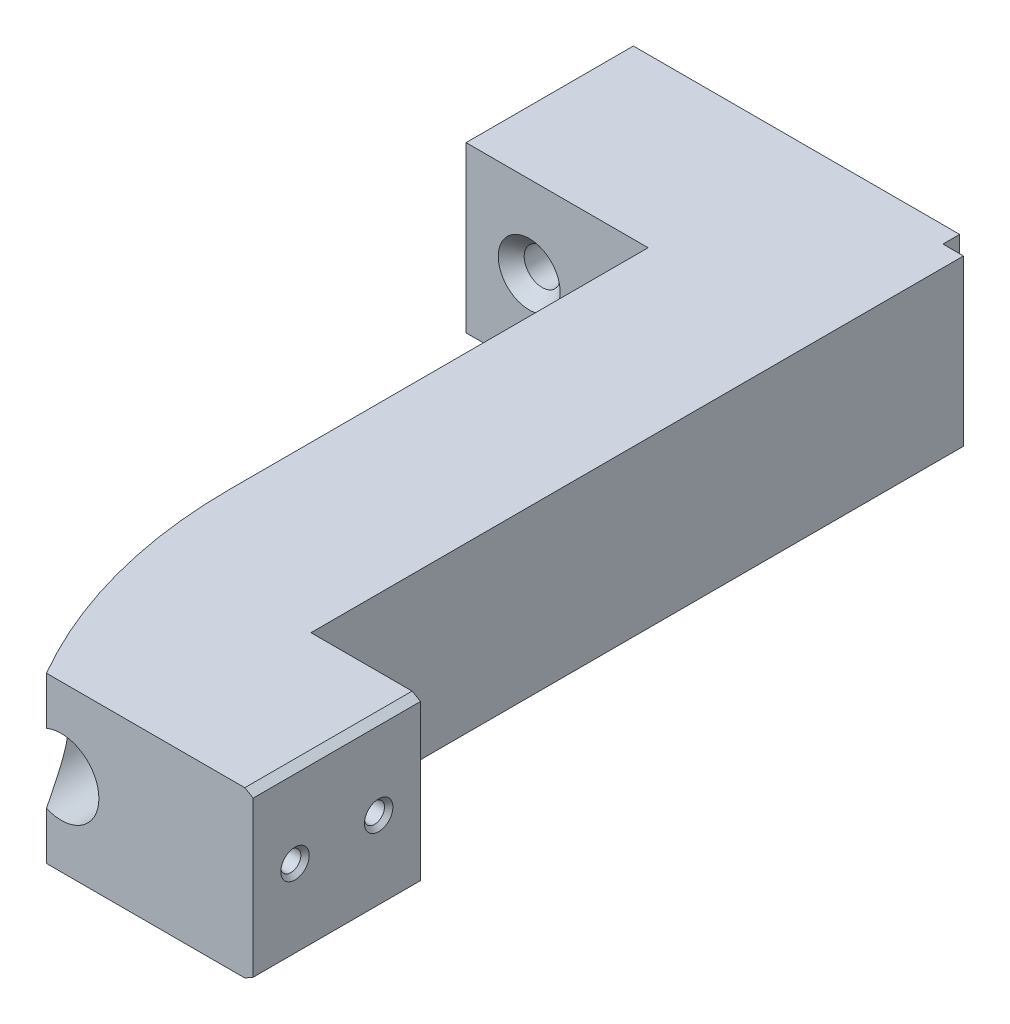
ISO-10303-21;
HEADER;
FILE_DESCRIPTION(('STEP AP214'),'2;1');
FILE_NAME('part.step','',(''),(''),'','','');
FILE_SCHEMA(('AUTOMOTIVE_DESIGN { 1 0 10303 214 1 1 1 1 }'));
ENDSEC;
DATA;
#1=APPLICATION_CONTEXT('core data for automotive mechanical design processes');
#2=APPLICATION_PROTOCOL_DEFINITION('international standard','automotive_design',2000,#1);
#3=PRODUCT_CONTEXT('',#1,'mechanical');
#4=PRODUCT('Part','Part','',(#3));
#5=PRODUCT_RELATED_PRODUCT_CATEGORY('part','',(#4));
#6=PRODUCT_DEFINITION_FORMATION('','',#4);
#7=PRODUCT_DEFINITION_CONTEXT('part definition',#1,'design');
#8=PRODUCT_DEFINITION('design','',#6,#7);
#9=PRODUCT_DEFINITION_SHAPE('','',#8);
#10=(LENGTH_UNIT() NAMED_UNIT(*) SI_UNIT(.MILLI.,.METRE.));
#11=(NAMED_UNIT(*) PLANE_ANGLE_UNIT() SI_UNIT($,.RADIAN.));
#12=(NAMED_UNIT(*) SI_UNIT($,.STERADIAN.) SOLID_ANGLE_UNIT());
#13=UNCERTAINTY_MEASURE_WITH_UNIT(LENGTH_MEASURE(1.E-05),#10,'distance_accuracy_value','');
#14=(GEOMETRIC_REPRESENTATION_CONTEXT(3) GLOBAL_UNCERTAINTY_ASSIGNED_CONTEXT((#13)) GLOBAL_UNIT_ASSIGNED_CONTEXT((#10,
#11,#12)) REPRESENTATION_CONTEXT('',''));
#15=CARTESIAN_POINT('',(0.,0.,0.));
#16=DIRECTION('',(0.,0.,1.));
#17=DIRECTION('',(1.,0.,0.));
#18=AXIS2_PLACEMENT_3D('',#15,#16,#17);
#19=CARTESIAN_POINT('',(41.4630883490828,0.,100.));
#20=DIRECTION('',(-1.,0.,0.));
#21=DIRECTION('',(0.,0.,1.));
#22=AXIS2_PLACEMENT_3D('',#19,#20,#21);
#23=PLANE('',#22);
#24=DIRECTION('',(0.,1.,0.));
#25=VECTOR('',#24,1.);
#26=CARTESIAN_POINT('',(41.4630883490828,19.7,80.));
#27=LINE('',#26,#25);
#28=CARTESIAN_POINT('',(41.4630883490828,0.,80.));
#29=VERTEX_POINT('',#28);
#30=CARTESIAN_POINT('',(41.4630883490828,19.7,80.));
#31=VERTEX_POINT('',#30);
#32=EDGE_CURVE('E168',#29,#31,#27,.T.);
#33=ORIENTED_EDGE('',*,*,#32,.F.);
#34=DIRECTION('',(0.,0.,-1.));
#35=VECTOR('',#34,1.);
#36=CARTESIAN_POINT('',(41.4630883490828,0.,100.));
#37=LINE('',#36,#35);
#38=CARTESIAN_POINT('',(41.4630883490828,0.,2.));
#39=VERTEX_POINT('',#38);
#40=EDGE_CURVE('E348',#29,#39,#37,.T.);
#41=ORIENTED_EDGE('',*,*,#40,.T.);
#42=DIRECTION('',(0.,-1.,0.));
#43=VECTOR('',#42,1.);
#44=CARTESIAN_POINT('',(41.4630883490828,19.7,2.));
#45=LINE('',#44,#43);
#46=CARTESIAN_POINT('',(41.4630883490828,19.7,2.));
#47=VERTEX_POINT('',#46);
#48=EDGE_CURVE('E371',#47,#39,#45,.T.);
#49=ORIENTED_EDGE('',*,*,#48,.F.);
#50=DIRECTION('',(0.,0.,-1.));
#51=VECTOR('',#50,1.);
#52=CARTESIAN_POINT('',(41.4630883490828,19.7,100.));
#53=LINE('',#52,#51);
#54=EDGE_CURVE('E350',#31,#47,#53,.T.);
#55=ORIENTED_EDGE('',*,*,#54,.F.);
#56=EDGE_LOOP('',(#33,#41,#49,#55));
#57=FACE_BOUND('',#56,.T.);
#58=ADVANCED_FACE('F35',(#57),#23,.F.);
#59=CARTESIAN_POINT('',(39.,0.,20.));
#60=DIRECTION('',(-1.,0.,0.));
#61=DIRECTION('',(0.,0.,1.));
#62=AXIS2_PLACEMENT_3D('',#59,#60,#61);
#63=PLANE('',#62);
#64=DIRECTION('',(0.,1.,0.));
#65=VECTOR('',#64,1.);
#66=CARTESIAN_POINT('',(39.,19.7,2.));
#67=LINE('',#66,#65);
#68=CARTESIAN_POINT('',(39.,0.,2.));
#69=VERTEX_POINT('',#68);
#70=CARTESIAN_POINT('',(39.,19.7,2.));
#71=VERTEX_POINT('',#70);
#72=EDGE_CURVE('E199',#69,#71,#67,.T.);
#73=ORIENTED_EDGE('',*,*,#72,.F.);
#74=DIRECTION('',(0.,0.,-1.));
#75=VECTOR('',#74,1.);
#76=CARTESIAN_POINT('',(39.,0.,20.));
#77=LINE('',#76,#75);
#78=CARTESIAN_POINT('',(39.,0.,0.));
#79=VERTEX_POINT('',#78);
#80=EDGE_CURVE('E304',#69,#79,#77,.T.);
#81=ORIENTED_EDGE('',*,*,#80,.T.);
#82=DIRECTION('',(0.,1.,0.));
#83=VECTOR('',#82,1.);
#84=CARTESIAN_POINT('',(39.,0.,0.));
#85=LINE('',#84,#83);
#86=CARTESIAN_POINT('',(39.,19.7,0.));
#87=VERTEX_POINT('',#86);
#88=EDGE_CURVE('E315',#79,#87,#85,.T.);
#89=ORIENTED_EDGE('',*,*,#88,.T.);
#90=DIRECTION('',(0.,0.,-1.));
#91=VECTOR('',#90,1.);
#92=CARTESIAN_POINT('',(39.,19.7,20.));
#93=LINE('',#92,#91);
#94=EDGE_CURVE('E306',#71,#87,#93,.T.);
#95=ORIENTED_EDGE('',*,*,#94,.F.);
#96=EDGE_LOOP('',(#73,#81,#89,#95));
#97=FACE_BOUND('',#96,.T.);
#98=ADVANCED_FACE('F224',(#97),#63,.F.);
#99=CARTESIAN_POINT('',(0.,0.,20.));
#100=DIRECTION('',(0.,0.,-1.));
#101=DIRECTION('',(-1.,0.,0.));
#102=AXIS2_PLACEMENT_3D('',#99,#100,#101);
#103=PLANE('',#102);
#104=CARTESIAN_POINT('',(7.55,9.85,20.));
#105=DIRECTION('',(0.,0.,1.));
#106=DIRECTION('',(1.,0.,0.));
#107=AXIS2_PLACEMENT_3D('',#104,#105,#106);
#108=CIRCLE('',#107,3.7);
#109=CARTESIAN_POINT('',(11.25,9.85,20.));
#110=VERTEX_POINT('',#109);
#111=EDGE_CURVE('E345',#110,#110,#108,.T.);
#112=ORIENTED_EDGE('',*,*,#111,.F.);
#113=EDGE_LOOP('',(#112));
#114=FACE_BOUND('',#113,.T.);
#115=DIRECTION('',(1.,0.,0.));
#116=VECTOR('',#115,1.);
#117=CARTESIAN_POINT('',(0.,0.,20.));
#118=LINE('',#117,#116);
#119=CARTESIAN_POINT('',(0.,0.,20.));
#120=VERTEX_POINT('',#119);
#121=CARTESIAN_POINT('',(21.7630883490828,0.,20.));
#122=VERTEX_POINT('',#121);
#123=EDGE_CURVE('E326',#120,#122,#118,.T.);
#124=ORIENTED_EDGE('',*,*,#123,.T.);
#125=DIRECTION('',(0.,1.,0.));
#126=VECTOR('',#125,1.);
#127=CARTESIAN_POINT('',(21.7630883490828,0.,20.));
#128=LINE('',#127,#126);
#129=CARTESIAN_POINT('',(21.7630883490828,19.7,20.));
#130=VERTEX_POINT('',#129);
#131=EDGE_CURVE('E361',#122,#130,#128,.T.);
#132=ORIENTED_EDGE('',*,*,#131,.T.);
#133=DIRECTION('',(-1.,0.,0.));
#134=VECTOR('',#133,1.);
#135=CARTESIAN_POINT('',(0.,19.7,20.));
#136=LINE('',#135,#134);
#137=CARTESIAN_POINT('',(0.,19.7,20.));
#138=VERTEX_POINT('',#137);
#139=EDGE_CURVE('E311',#130,#138,#136,.T.);
#140=ORIENTED_EDGE('',*,*,#139,.T.);
#141=DIRECTION('',(0.,-1.,0.));
#142=VECTOR('',#141,1.);
#143=CARTESIAN_POINT('',(0.,0.,20.));
#144=LINE('',#143,#142);
#145=EDGE_CURVE('E314',#138,#120,#144,.T.);
#146=ORIENTED_EDGE('',*,*,#145,.T.);
#147=EDGE_LOOP('',(#124,#132,#140,#146));
#148=FACE_BOUND('',#147,.T.);
#149=ADVANCED_FACE('F230',(#114,#148),#103,.F.);
#150=CARTESIAN_POINT('',(31.6130883490828,9.85,20.));
#151=DIRECTION('',(0.,0.,1.));
#152=DIRECTION('',(1.,0.,0.));
#153=AXIS2_PLACEMENT_3D('',#150,#151,#152);
#154=CIRCLE('',#153,3.7);
#155=CARTESIAN_POINT('',(35.3130883490828,9.85,20.));
#156=VERTEX_POINT('',#155);
#157=EDGE_CURVE('E336',#156,#156,#154,.T.);
#158=ORIENTED_EDGE('',*,*,#157,.F.);
#159=EDGE_LOOP('',(#158));
#160=FACE_BOUND('',#159,.T.);
#161=CARTESIAN_POINT('',(31.6130883490828,9.85,20.));
#162=DIRECTION('',(0.,0.,1.));
#163=DIRECTION('',(1.,0.,0.));
#164=AXIS2_PLACEMENT_3D('',#161,#162,#163);
#165=CIRCLE('',#164,4.5);
#166=CARTESIAN_POINT('',(36.1130883490828,9.85,20.));
#167=VERTEX_POINT('',#166);
#168=EDGE_CURVE('E357',#167,#167,#165,.T.);
#169=ORIENTED_EDGE('',*,*,#168,.T.);
#170=EDGE_LOOP('',(#169));
#171=FACE_BOUND('',#170,.T.);
#172=ADVANCED_FACE('F254',(#160,#171),#103,.F.);
#173=CARTESIAN_POINT('',(0.,0.,20.));
#174=DIRECTION('',(1.,0.,0.));
#175=DIRECTION('',(0.,0.,-1.));
#176=AXIS2_PLACEMENT_3D('',#173,#174,#175);
#177=PLANE('',#176);
#178=DIRECTION('',(0.,-1.,0.));
#179=VECTOR('',#178,1.);
#180=CARTESIAN_POINT('',(0.,0.,0.));
#181=LINE('',#180,#179);
#182=CARTESIAN_POINT('',(0.,19.7,0.));
#183=VERTEX_POINT('',#182);
#184=CARTESIAN_POINT('',(0.,0.,0.));
#185=VERTEX_POINT('',#184);
#186=EDGE_CURVE('E321',#183,#185,#181,.T.);
#187=ORIENTED_EDGE('',*,*,#186,.T.);
#188=DIRECTION('',(0.,0.,-1.));
#189=VECTOR('',#188,1.);
#190=CARTESIAN_POINT('',(0.,0.,20.));
#191=LINE('',#190,#189);
#192=EDGE_CURVE('E301',#120,#185,#191,.T.);
#193=ORIENTED_EDGE('',*,*,#192,.F.);
#194=ORIENTED_EDGE('',*,*,#145,.F.);
#195=DIRECTION('',(0.,0.,-1.));
#196=VECTOR('',#195,1.);
#197=CARTESIAN_POINT('',(0.,19.7,20.));
#198=LINE('',#197,#196);
#199=EDGE_CURVE('E308',#138,#183,#198,.T.);
#200=ORIENTED_EDGE('',*,*,#199,.T.);
#201=EDGE_LOOP('',(#187,#193,#194,#200));
#202=FACE_BOUND('',#201,.T.);
#203=ADVANCED_FACE('F266',(#202),#177,.F.);
#204=CARTESIAN_POINT('',(0.,0.,20.));
#205=DIRECTION('',(0.,1.,0.));
#206=DIRECTION('',(0.,0.,1.));
#207=AXIS2_PLACEMENT_3D('',#204,#205,#206);
#208=PLANE('',#207);
#209=DIRECTION('',(-1.,0.,0.));
#210=VECTOR('',#209,1.);
#211=CARTESIAN_POINT('',(54.5530883490828,0.,80.));
#212=LINE('',#211,#210);
#213=CARTESIAN_POINT('',(53.5530883490828,0.,80.));
#214=VERTEX_POINT('',#213);
#215=EDGE_CURVE('E179',#214,#29,#212,.T.);
#216=ORIENTED_EDGE('',*,*,#215,.F.);
#217=DIRECTION('',(0.,0.,1.));
#218=VECTOR('',#217,1.);
#219=CARTESIAN_POINT('',(53.5530883490828,0.,100.));
#220=LINE('',#219,#218);
#221=CARTESIAN_POINT('',(53.5530883490828,0.,100.));
#222=VERTEX_POINT('',#221);
#223=EDGE_CURVE('E59',#214,#222,#220,.T.);
#224=ORIENTED_EDGE('',*,*,#223,.T.);
#225=DIRECTION('',(1.,0.,0.));
#226=VECTOR('',#225,1.);
#227=CARTESIAN_POINT('',(0.,0.,100.));
#228=LINE('',#227,#226);
#229=CARTESIAN_POINT('',(29.8482648969,0.,100.));
#230=VERTEX_POINT('',#229);
#231=EDGE_CURVE('E360',#230,#222,#228,.T.);
#232=ORIENTED_EDGE('',*,*,#231,.F.);
#233=CARTESIAN_POINT('',(81.4630883490828,0.,70.));
#234=DIRECTION('',(0.,-1.,0.));
#235=DIRECTION('',(0.,0.,1.));
#236=AXIS2_PLACEMENT_3D('',#233,#234,#235);
#237=CIRCLE('',#236,59.7);
#238=CARTESIAN_POINT('',(21.7630883490828,0.,70.));
#239=VERTEX_POINT('',#238);
#240=EDGE_CURVE('E182',#230,#239,#237,.T.);
#241=ORIENTED_EDGE('',*,*,#240,.T.);
#242=DIRECTION('',(0.,0.,-1.));
#243=VECTOR('',#242,1.);
#244=CARTESIAN_POINT('',(21.7630883490828,0.,100.));
#245=LINE('',#244,#243);
#246=EDGE_CURVE('E354',#239,#122,#245,.T.);
#247=ORIENTED_EDGE('',*,*,#246,.T.);
#248=ORIENTED_EDGE('',*,*,#123,.F.);
#249=ORIENTED_EDGE('',*,*,#192,.T.);
#250=DIRECTION('',(1.,0.,0.));
#251=VECTOR('',#250,1.);
#252=CARTESIAN_POINT('',(0.,0.,0.));
#253=LINE('',#252,#251);
#254=EDGE_CURVE('E318',#185,#79,#253,.T.);
#255=ORIENTED_EDGE('',*,*,#254,.T.);
#256=ORIENTED_EDGE('',*,*,#80,.F.);
#257=DIRECTION('',(-1.,0.,0.));
#258=VECTOR('',#257,1.);
#259=CARTESIAN_POINT('',(39.,0.,2.));
#260=LINE('',#259,#258);
#261=EDGE_CURVE('E364',#39,#69,#260,.T.);
#262=ORIENTED_EDGE('',*,*,#261,.F.);
#263=ORIENTED_EDGE('',*,*,#40,.F.);
#264=EDGE_LOOP('',(#216,#224,#232,#241,#247,#248,#249,#255,#256,#262,#263));
#265=FACE_BOUND('',#264,.T.);
#266=ADVANCED_FACE('F261',(#265),#208,.F.);
#267=CARTESIAN_POINT('',(0.,19.7,20.));
#268=DIRECTION('',(0.,-1.,0.));
#269=DIRECTION('',(0.,0.,-1.));
#270=AXIS2_PLACEMENT_3D('',#267,#268,#269);
#271=PLANE('',#270);
#272=DIRECTION('',(-1.,0.,0.));
#273=VECTOR('',#272,1.);
#274=CARTESIAN_POINT('',(0.,19.7,100.));
#275=LINE('',#274,#273);
#276=CARTESIAN_POINT('',(53.5530883490828,19.7,100.));
#277=VERTEX_POINT('',#276);
#278=CARTESIAN_POINT('',(29.8482648969,19.7,100.));
#279=VERTEX_POINT('',#278);
#280=EDGE_CURVE('E367',#277,#279,#275,.T.);
#281=ORIENTED_EDGE('',*,*,#280,.F.);
#282=DIRECTION('',(0.,0.,-1.));
#283=VECTOR('',#282,1.);
#284=CARTESIAN_POINT('',(53.5530883490828,19.7,80.));
#285=LINE('',#284,#283);
#286=CARTESIAN_POINT('',(53.5530883490828,19.7,80.));
#287=VERTEX_POINT('',#286);
#288=EDGE_CURVE('E11',#277,#287,#285,.T.);
#289=ORIENTED_EDGE('',*,*,#288,.T.);
#290=DIRECTION('',(-1.,0.,0.));
#291=VECTOR('',#290,1.);
#292=CARTESIAN_POINT('',(54.5530883490828,19.7,80.));
#293=LINE('',#292,#291);
#294=EDGE_CURVE('E175',#287,#31,#293,.T.);
#295=ORIENTED_EDGE('',*,*,#294,.T.);
#296=ORIENTED_EDGE('',*,*,#54,.T.);
#297=DIRECTION('',(1.,0.,0.));
#298=VECTOR('',#297,1.);
#299=CARTESIAN_POINT('',(39.,19.7,2.));
#300=LINE('',#299,#298);
#301=EDGE_CURVE('E373',#71,#47,#300,.T.);
#302=ORIENTED_EDGE('',*,*,#301,.F.);
#303=ORIENTED_EDGE('',*,*,#94,.T.);
#304=DIRECTION('',(-1.,0.,0.));
#305=VECTOR('',#304,1.);
#306=CARTESIAN_POINT('',(0.,19.7,0.));
#307=LINE('',#306,#305);
#308=EDGE_CURVE('E312',#87,#183,#307,.T.);
#309=ORIENTED_EDGE('',*,*,#308,.T.);
#310=ORIENTED_EDGE('',*,*,#199,.F.);
#311=ORIENTED_EDGE('',*,*,#139,.F.);
#312=DIRECTION('',(0.,0.,-1.));
#313=VECTOR('',#312,1.);
#314=CARTESIAN_POINT('',(21.7630883490828,19.7,100.));
#315=LINE('',#314,#313);
#316=CARTESIAN_POINT('',(21.7630883490828,19.7,70.));
#317=VERTEX_POINT('',#316);
#318=EDGE_CURVE('E352',#317,#130,#315,.T.);
#319=ORIENTED_EDGE('',*,*,#318,.F.);
#320=CARTESIAN_POINT('',(81.4630883490828,19.7,70.));
#321=DIRECTION('',(0.,-1.,0.));
#322=DIRECTION('',(0.,0.,1.));
#323=AXIS2_PLACEMENT_3D('',#320,#321,#322);
#324=CIRCLE('',#323,59.7);
#325=EDGE_CURVE('E181',#279,#317,#324,.T.);
#326=ORIENTED_EDGE('',*,*,#325,.F.);
#327=EDGE_LOOP('',(#281,#289,#295,#296,#302,#303,#309,#310,#311,#319,#326));
#328=FACE_BOUND('',#327,.T.);
#329=ADVANCED_FACE('F258',(#328),#271,.F.);
#330=CARTESIAN_POINT('',(0.,0.,0.));
#331=DIRECTION('',(0.,0.,-1.));
#332=DIRECTION('',(-1.,0.,0.));
#333=AXIS2_PLACEMENT_3D('',#330,#331,#332);
#334=PLANE('',#333);
#335=CARTESIAN_POINT('',(7.55,9.85,0.));
#336=DIRECTION('',(0.,0.,-1.));
#337=DIRECTION('',(-1.,0.,0.));
#338=AXIS2_PLACEMENT_3D('',#335,#336,#337);
#339=CIRCLE('',#338,2.14999999999999);
#340=CARTESIAN_POINT('',(5.40000000000001,9.85,0.));
#341=VERTEX_POINT('',#340);
#342=EDGE_CURVE('E339',#341,#341,#339,.T.);
#343=ORIENTED_EDGE('',*,*,#342,.F.);
#344=EDGE_LOOP('',(#343));
#345=FACE_BOUND('',#344,.T.);
#346=CARTESIAN_POINT('',(31.6130883490828,9.85,0.));
#347=DIRECTION('',(0.,0.,-1.));
#348=DIRECTION('',(-1.,0.,0.));
#349=AXIS2_PLACEMENT_3D('',#346,#347,#348);
#350=CIRCLE('',#349,2.14999999999999);
#351=CARTESIAN_POINT('',(29.4630883490828,9.85,0.));
#352=VERTEX_POINT('',#351);
#353=EDGE_CURVE('E324',#352,#352,#350,.T.);
#354=ORIENTED_EDGE('',*,*,#353,.F.);
#355=EDGE_LOOP('',(#354));
#356=FACE_BOUND('',#355,.T.);
#357=ORIENTED_EDGE('',*,*,#186,.F.);
#358=ORIENTED_EDGE('',*,*,#308,.F.);
#359=ORIENTED_EDGE('',*,*,#88,.F.);
#360=ORIENTED_EDGE('',*,*,#254,.F.);
#361=EDGE_LOOP('',(#357,#358,#359,#360));
#362=FACE_BOUND('',#361,.T.);
#363=ADVANCED_FACE('F250',(#345,#356,#362),#334,.T.);
#364=CARTESIAN_POINT('',(31.6130883490828,9.85,20.));
#365=DIRECTION('',(0.,0.,1.));
#366=DIRECTION('',(1.,0.,0.));
#367=AXIS2_PLACEMENT_3D('',#364,#365,#366);
#368=CYLINDRICAL_SURFACE('',#367,2.14999999999999);
#369=CARTESIAN_POINT('',(31.6130883490828,9.85,18.45));
#370=DIRECTION('',(0.,0.,1.));
#371=DIRECTION('',(1.,0.,0.));
#372=AXIS2_PLACEMENT_3D('',#369,#370,#371);
#373=CIRCLE('',#372,2.14999999999999);
#374=CARTESIAN_POINT('',(33.7630883490828,9.85,18.45));
#375=VERTEX_POINT('',#374);
#376=EDGE_CURVE('E333',#375,#375,#373,.T.);
#377=ORIENTED_EDGE('',*,*,#376,.T.);
#378=EDGE_LOOP('',(#377));
#379=FACE_BOUND('',#378,.T.);
#380=ORIENTED_EDGE('',*,*,#353,.T.);
#381=EDGE_LOOP('',(#380));
#382=FACE_BOUND('',#381,.T.);
#383=ADVANCED_FACE('F246',(#379,#382),#368,.F.);
#384=CARTESIAN_POINT('',(31.6130883490828,9.85,20.));
#385=DIRECTION('',(0.,0.,1.));
#386=DIRECTION('',(1.,0.,0.));
#387=AXIS2_PLACEMENT_3D('',#384,#385,#386);
#388=CONICAL_SURFACE('',#387,3.7,0.785398163397447);
#389=ORIENTED_EDGE('',*,*,#376,.F.);
#390=EDGE_LOOP('',(#389));
#391=FACE_BOUND('',#390,.T.);
#392=ORIENTED_EDGE('',*,*,#157,.T.);
#393=EDGE_LOOP('',(#392));
#394=FACE_BOUND('',#393,.T.);
#395=ADVANCED_FACE('F242',(#391,#394),#388,.F.);
#396=CARTESIAN_POINT('',(7.55,9.85,20.));
#397=DIRECTION('',(0.,0.,1.));
#398=DIRECTION('',(1.,0.,0.));
#399=AXIS2_PLACEMENT_3D('',#396,#397,#398);
#400=CYLINDRICAL_SURFACE('',#399,2.14999999999999);
#401=CARTESIAN_POINT('',(7.55,9.85,18.45));
#402=DIRECTION('',(0.,0.,1.));
#403=DIRECTION('',(1.,0.,0.));
#404=AXIS2_PLACEMENT_3D('',#401,#402,#403);
#405=CIRCLE('',#404,2.14999999999999);
#406=CARTESIAN_POINT('',(9.69999999999999,9.85,18.45));
#407=VERTEX_POINT('',#406);
#408=EDGE_CURVE('E342',#407,#407,#405,.T.);
#409=ORIENTED_EDGE('',*,*,#408,.T.);
#410=EDGE_LOOP('',(#409));
#411=FACE_BOUND('',#410,.T.);
#412=ORIENTED_EDGE('',*,*,#342,.T.);
#413=EDGE_LOOP('',(#412));
#414=FACE_BOUND('',#413,.T.);
#415=ADVANCED_FACE('F238',(#411,#414),#400,.F.);
#416=CARTESIAN_POINT('',(7.55,9.85,20.));
#417=DIRECTION('',(0.,0.,1.));
#418=DIRECTION('',(1.,0.,0.));
#419=AXIS2_PLACEMENT_3D('',#416,#417,#418);
#420=CONICAL_SURFACE('',#419,3.7,0.785398163397447);
#421=ORIENTED_EDGE('',*,*,#408,.F.);
#422=EDGE_LOOP('',(#421));
#423=FACE_BOUND('',#422,.T.);
#424=ORIENTED_EDGE('',*,*,#111,.T.);
#425=EDGE_LOOP('',(#424));
#426=FACE_BOUND('',#425,.T.);
#427=ADVANCED_FACE('F235',(#423,#426),#420,.F.);
#428=CARTESIAN_POINT('',(21.7630883490828,0.,100.));
#429=DIRECTION('',(-1.,0.,0.));
#430=DIRECTION('',(0.,-1.,0.));
#431=AXIS2_PLACEMENT_3D('',#428,#429,#430);
#432=PLANE('',#431);
#433=DIRECTION('',(0.,1.,0.));
#434=VECTOR('',#433,1.);
#435=CARTESIAN_POINT('',(21.7630883490828,0.,70.));
#436=LINE('',#435,#434);
#437=EDGE_CURVE('E185',#239,#317,#436,.T.);
#438=ORIENTED_EDGE('',*,*,#437,.T.);
#439=ORIENTED_EDGE('',*,*,#318,.T.);
#440=ORIENTED_EDGE('',*,*,#131,.F.);
#441=ORIENTED_EDGE('',*,*,#246,.F.);
#442=EDGE_LOOP('',(#438,#439,#440,#441));
#443=FACE_BOUND('',#442,.T.);
#444=ADVANCED_FACE('F221',(#443),#432,.T.);
#445=CARTESIAN_POINT('',(31.6130883490828,9.85,100.));
#446=DIRECTION('',(0.,0.,-1.));
#447=DIRECTION('',(-1.,0.,0.));
#448=AXIS2_PLACEMENT_3D('',#445,#446,#447);
#449=CYLINDRICAL_SURFACE('',#448,4.5);
#450=CARTESIAN_POINT('',(29.8482648969,5.71050749697193,100.));
#451=CARTESIAN_POINT('',(29.7573327363336,5.7492915407916,99.8435552754339));
#452=CARTESIAN_POINT('',(29.6674409236068,5.79114176766117,99.6872563227438));
#453=CARTESIAN_POINT('',(29.4898253914112,5.88115816776018,99.3751956909919));
#454=CARTESIAN_POINT('',(29.4021021923884,5.92932583995793,99.2194341484741));
#455=CARTESIAN_POINT('',(29.2282246339589,6.03257590888257,98.9074589558449));
#456=CARTESIAN_POINT('',(29.1420897398109,6.08771318552003,98.751252567854));
#457=CARTESIAN_POINT('',(28.9723027890027,6.20488088465941,98.4400920503629));
#458=CARTESIAN_POINT('',(28.8886505399666,6.26691077128805,98.2851378245154));
#459=CARTESIAN_POINT('',(28.7193796971349,6.40198222782546,97.9682898151554));
#460=CARTESIAN_POINT('',(28.6339135927179,6.47544607504424,97.8064937345288));
#461=CARTESIAN_POINT('',(28.4662161839201,6.63125815418113,97.485529134678));
#462=CARTESIAN_POINT('',(28.3839844993272,6.71360533756157,97.3263603078997));
#463=CARTESIAN_POINT('',(28.2234043689128,6.88789912777069,97.0121652034036));
#464=CARTESIAN_POINT('',(28.1450437952242,6.97981252481124,96.8571267957874));
#465=CARTESIAN_POINT('',(27.9925113182906,7.17478901833796,96.5521448725778));
#466=CARTESIAN_POINT('',(27.9183368149126,7.27784507504326,96.4021982178754));
#467=CARTESIAN_POINT('',(27.8013576571921,7.45676902438222,96.1633200516963));
#468=CARTESIAN_POINT('',(27.7570350095204,7.52872552964363,96.0722011843658));
#469=CARTESIAN_POINT('',(27.6707330123241,7.67852229353251,95.8936735032703));
#470=CARTESIAN_POINT('',(27.6287544380072,7.75636447881049,95.806265919126));
#471=CARTESIAN_POINT('',(27.547942981744,7.91798230196027,95.6370010439462));
#472=CARTESIAN_POINT('',(27.5090878567034,8.00170617277274,95.5551053405366));
#473=CARTESIAN_POINT('',(27.4348276184277,8.17634137740738,95.3977283510213));
#474=CARTESIAN_POINT('',(27.3994199901016,8.26724738251887,95.322242393962));
#475=CARTESIAN_POINT('',(27.3295417793218,8.46670405630051,95.1725369611513));
#476=CARTESIAN_POINT('',(27.2955302221009,8.57610920691733,95.0992219459865));
#477=CARTESIAN_POINT('',(27.2344499816235,8.80523458861749,94.966980082151));
#478=CARTESIAN_POINT('',(27.2073761634249,8.92494710255227,94.9080425935674));
#479=CARTESIAN_POINT('',(27.1660948184226,9.15331107291617,94.8179078929222));
#480=CARTESIAN_POINT('',(27.1504993462804,9.26051320716756,94.7837336977656));
#481=CARTESIAN_POINT('',(27.1270011519775,9.47969808522657,94.7321744532177));
#482=CARTESIAN_POINT('',(27.1190896278567,9.5916752053654,94.7147701940513));
#483=CARTESIAN_POINT('',(27.1117775650123,9.81779595809533,94.6986863909995));
#484=CARTESIAN_POINT('',(27.1124151908843,9.93194703248659,94.700090811647));
#485=CARTESIAN_POINT('',(27.1222172442084,10.1580937449164,94.7216473779651));
#486=CARTESIAN_POINT('',(27.1313875657166,10.2700878384085,94.7418124827895));
#487=CARTESIAN_POINT('',(27.1595770442737,10.5080421275882,94.8036284545964));
#488=CARTESIAN_POINT('',(27.1800451437581,10.6329927377044,94.848435327978));
#489=CARTESIAN_POINT('',(27.2292597122891,10.8733215293115,94.9556661641982));
#490=CARTESIAN_POINT('',(27.2580220596402,10.9886807984308,95.0181239128091));
#491=CARTESIAN_POINT('',(27.3155020506295,11.1876303397287,95.1422478222525));
#492=CARTESIAN_POINT('',(27.3431113300617,11.2730009950482,95.2016440346989));
#493=CARTESIAN_POINT('',(27.401594416458,11.4377548075694,95.3268562670323));
#494=CARTESIAN_POINT('',(27.4324703622868,11.5171339828207,95.3926764908569));
#495=CARTESIAN_POINT('',(27.4969291960199,11.6704854238026,95.5293828491457));
#496=CARTESIAN_POINT('',(27.5305172664823,11.7444467968546,95.6002786516931));
#497=CARTESIAN_POINT('',(27.5999147928075,11.8873363530193,95.745971822588));
#498=CARTESIAN_POINT('',(27.6357251181799,11.9562625427386,95.820770716267));
#499=CARTESIAN_POINT('',(27.7461035489741,12.1564582135005,96.0500334254643));
#500=CARTESIAN_POINT('',(27.8235058814967,12.2808847902669,96.2091223350988));
#501=CARTESIAN_POINT('',(27.984103707863,12.5146879926519,96.535285717438));
#502=CARTESIAN_POINT('',(28.067305018983,12.624049168333,96.7023681546488));
#503=CARTESIAN_POINT('',(28.2387247566534,12.8302159168065,97.0424387627452));
#504=CARTESIAN_POINT('',(28.3269582797465,12.9269805056485,97.2154440064317));
#505=CARTESIAN_POINT('',(28.5075137432614,13.1091154024648,97.5651200569947));
#506=CARTESIAN_POINT('',(28.5998339943127,13.1944903611707,97.7417893334752));
#507=CARTESIAN_POINT('',(28.7845880221157,13.3519630993275,98.0909795101427));
#508=CARTESIAN_POINT('',(28.8768836995535,13.4244425815519,98.2634023199366));
#509=CARTESIAN_POINT('',(29.0646441117961,13.5606439761076,98.6099965420983));
#510=CARTESIAN_POINT('',(29.1601092942212,13.6243646448679,98.7841681990072));
#511=CARTESIAN_POINT('',(29.3528267023257,13.7427967380289,99.1315910758218));
#512=CARTESIAN_POINT('',(29.4500436761449,13.7976072082317,99.3048282119902));
#513=CARTESIAN_POINT('',(29.6471672056533,13.8993698039777,99.6519852826469));
#514=CARTESIAN_POINT('',(29.7470726888689,13.9463250106639,99.825904921905));
#515=CARTESIAN_POINT('',(29.8482648969,13.9894925030281,100.));
#516=B_SPLINE_CURVE_WITH_KNOTS('',3,(#450,#451,#452,#453,#454,#455,#456,#457,#458,#459,#460,
#461,#462,#463,#464,#465,#466,#467,#468,#469,#470,#471,#472,#473,#474,#475,#476,#477,#478,#479,
#480,#481,#482,#483,#484,#485,#486,#487,#488,#489,#490,#491,#492,#493,#494,#495,#496,#497,#498,
#499,#500,#501,#502,#503,#504,#505,#506,#507,#508,#509,#510,#511,#512,#513,#514,#515),
.UNSPECIFIED.,.F.,.F.,(4,2,2,2,2,2,2,2,2,2,2,2,2,2,2,2,2,2,2,2,2,2,2,2,2,2,2,2,2,2,2,2,4),(0.,
0.555168391350228,1.11046874908873,1.67045136382442,2.2303904725393,2.8217066787929,
3.41295316570818,4.00221154694249,4.59109979438234,4.96375761263321,5.33653795129814,
5.70637152204132,6.07593322991741,6.48296617143082,6.88969697312685,7.22909999540423,
7.56811377146598,7.90864145419468,8.24940453503838,8.65012170622785,9.05161115183221,
9.37397400146308,9.6965492414016,10.0197561755412,10.343090379268,10.9908686690053,
11.6393064030024,12.2898037823468,12.9400347255226,13.5655136206015,14.1910812292628,
14.8091327718262,15.4269413189816),.UNSPECIFIED.);
#517=CARTESIAN_POINT('',(29.8482648969,5.71050749697193,100.));
#518=VERTEX_POINT('',#517);
#519=CARTESIAN_POINT('',(29.8482648969,13.9894925030281,100.));
#520=VERTEX_POINT('',#519);
#521=EDGE_CURVE('E189',#518,#520,#516,.T.);
#522=ORIENTED_EDGE('',*,*,#521,.F.);
#523=CARTESIAN_POINT('',(31.6130883490828,9.85,100.));
#524=DIRECTION('',(0.,0.,1.));
#525=DIRECTION('',(1.,0.,0.));
#526=AXIS2_PLACEMENT_3D('',#523,#524,#525);
#527=CIRCLE('',#526,4.5);
#528=EDGE_CURVE('E356',#518,#520,#527,.T.);
#529=ORIENTED_EDGE('',*,*,#528,.T.);
#530=EDGE_LOOP('',(#522,#529));
#531=FACE_BOUND('',#530,.T.);
#532=ORIENTED_EDGE('',*,*,#168,.F.);
#533=EDGE_LOOP('',(#532));
#534=FACE_BOUND('',#533,.T.);
#535=ADVANCED_FACE('F201',(#531,#534),#449,.F.);
#536=CARTESIAN_POINT('',(0.,0.,100.));
#537=DIRECTION('',(0.,0.,1.));
#538=DIRECTION('',(1.,0.,0.));
#539=AXIS2_PLACEMENT_3D('',#536,#537,#538);
#540=PLANE('',#539);
#541=ORIENTED_EDGE('',*,*,#231,.T.);
#542=DIRECTION('',(0.866025403784439,0.499999999999999,0.));
#543=VECTOR('',#542,1.);
#544=CARTESIAN_POINT('',(13.3882720872707,-23.189167480709,100.));
#545=LINE('',#544,#543);
#546=CARTESIAN_POINT('',(54.5530883490828,0.577350269189633,100.));
#547=VERTEX_POINT('',#546);
#548=EDGE_CURVE('E44',#222,#547,#545,.T.);
#549=ORIENTED_EDGE('',*,*,#548,.T.);
#550=DIRECTION('',(0.,-1.,0.));
#551=VECTOR('',#550,1.);
#552=CARTESIAN_POINT('',(54.5530883490828,19.7,100.));
#553=LINE('',#552,#551);
#554=CARTESIAN_POINT('',(54.5530883490828,19.1226497308104,100.));
#555=VERTEX_POINT('',#554);
#556=EDGE_CURVE('E169',#555,#547,#553,.T.);
#557=ORIENTED_EDGE('',*,*,#556,.F.);
#558=DIRECTION('',(-0.866025403784439,0.499999999999999,0.));
#559=VECTOR('',#558,1.);
#560=CARTESIAN_POINT('',(21.9186223145474,37.9641674807091,100.));
#561=LINE('',#560,#559);
#562=EDGE_CURVE('E51',#555,#277,#561,.T.);
#563=ORIENTED_EDGE('',*,*,#562,.T.);
#564=ORIENTED_EDGE('',*,*,#280,.T.);
#565=DIRECTION('',(0.,1.,0.));
#566=VECTOR('',#565,1.);
#567=CARTESIAN_POINT('',(29.8482648969,0.,100.));
#568=LINE('',#567,#566);
#569=EDGE_CURVE('E298',#520,#279,#568,.T.);
#570=ORIENTED_EDGE('',*,*,#569,.F.);
#571=ORIENTED_EDGE('',*,*,#528,.F.);
#572=DIRECTION('',(0.,1.,0.));
#573=VECTOR('',#572,1.);
#574=CARTESIAN_POINT('',(29.8482648969,0.,100.));
#575=LINE('',#574,#573);
#576=EDGE_CURVE('E187',#230,#518,#575,.T.);
#577=ORIENTED_EDGE('',*,*,#576,.F.);
#578=EDGE_LOOP('',(#541,#549,#557,#563,#564,#570,#571,#577));
#579=FACE_BOUND('',#578,.T.);
#580=ADVANCED_FACE('F215',(#579),#540,.T.);
#581=CARTESIAN_POINT('',(0.,0.,2.));
#582=DIRECTION('',(0.,0.,1.));
#583=DIRECTION('',(1.,0.,0.));
#584=AXIS2_PLACEMENT_3D('',#581,#582,#583);
#585=PLANE('',#584);
#586=ORIENTED_EDGE('',*,*,#72,.T.);
#587=ORIENTED_EDGE('',*,*,#301,.T.);
#588=ORIENTED_EDGE('',*,*,#48,.T.);
#589=ORIENTED_EDGE('',*,*,#261,.T.);
#590=EDGE_LOOP('',(#586,#587,#588,#589));
#591=FACE_BOUND('',#590,.T.);
#592=ADVANCED_FACE('F211',(#591),#585,.F.);
#593=CARTESIAN_POINT('',(81.4630883490828,0.,70.));
#594=DIRECTION('',(0.,1.,0.));
#595=DIRECTION('',(0.,0.,1.));
#596=AXIS2_PLACEMENT_3D('',#593,#594,#595);
#597=CYLINDRICAL_SURFACE('',#596,59.7);
#598=ORIENTED_EDGE('',*,*,#521,.T.);
#599=ORIENTED_EDGE('',*,*,#569,.T.);
#600=ORIENTED_EDGE('',*,*,#325,.T.);
#601=ORIENTED_EDGE('',*,*,#437,.F.);
#602=ORIENTED_EDGE('',*,*,#240,.F.);
#603=ORIENTED_EDGE('',*,*,#576,.T.);
#604=EDGE_LOOP('',(#598,#599,#600,#601,#602,#603));
#605=FACE_BOUND('',#604,.T.);
#606=ADVANCED_FACE('F205',(#605),#597,.T.);
#607=CARTESIAN_POINT('',(54.5530883490828,19.7,80.));
#608=DIRECTION('',(0.,0.,1.));
#609=DIRECTION('',(1.,0.,0.));
#610=AXIS2_PLACEMENT_3D('',#607,#608,#609);
#611=PLANE('',#610);
#612=DIRECTION('',(0.,1.,0.));
#613=VECTOR('',#612,1.);
#614=CARTESIAN_POINT('',(54.5530883490828,19.7,80.));
#615=LINE('',#614,#613);
#616=CARTESIAN_POINT('',(54.5530883490828,0.577350269189633,80.));
#617=VERTEX_POINT('',#616);
#618=CARTESIAN_POINT('',(54.5530883490828,19.1226497308104,80.));
#619=VERTEX_POINT('',#618);
#620=EDGE_CURVE('E172',#617,#619,#615,.T.);
#621=ORIENTED_EDGE('',*,*,#620,.F.);
#622=DIRECTION('',(-0.866025403784439,-0.499999999999999,0.));
#623=VECTOR('',#622,1.);
#624=CARTESIAN_POINT('',(54.5530883490828,0.577350269189633,80.));
#625=LINE('',#624,#623);
#626=EDGE_CURVE('E290',#617,#214,#625,.T.);
#627=ORIENTED_EDGE('',*,*,#626,.T.);
#628=ORIENTED_EDGE('',*,*,#215,.T.);
#629=ORIENTED_EDGE('',*,*,#32,.T.);
#630=ORIENTED_EDGE('',*,*,#294,.F.);
#631=DIRECTION('',(0.866025403784439,-0.499999999999999,0.));
#632=VECTOR('',#631,1.);
#633=CARTESIAN_POINT('',(54.5530883490828,19.1226497308104,80.));
#634=LINE('',#633,#632);
#635=EDGE_CURVE('E292',#287,#619,#634,.T.);
#636=ORIENTED_EDGE('',*,*,#635,.T.);
#637=EDGE_LOOP('',(#621,#627,#628,#629,#630,#636));
#638=FACE_BOUND('',#637,.T.);
#639=ADVANCED_FACE('F210',(#638),#611,.F.);
#640=CARTESIAN_POINT('',(54.5530883490828,0.,0.));
#641=DIRECTION('',(1.,0.,0.));
#642=DIRECTION('',(0.,0.,-1.));
#643=AXIS2_PLACEMENT_3D('',#640,#641,#642);
#644=PLANE('',#643);
#645=CARTESIAN_POINT('',(54.5530883490828,9.85000000000001,95.));
#646=DIRECTION('',(1.,0.,0.));
#647=DIRECTION('',(0.,0.,-1.));
#648=AXIS2_PLACEMENT_3D('',#645,#646,#647);
#649=CIRCLE('',#648,1.7);
#650=CARTESIAN_POINT('',(54.5530883490828,9.85000000000001,93.3));
#651=VERTEX_POINT('',#650);
#652=EDGE_CURVE('E159',#651,#651,#649,.T.);
#653=ORIENTED_EDGE('',*,*,#652,.F.);
#654=EDGE_LOOP('',(#653));
#655=FACE_BOUND('',#654,.T.);
#656=CARTESIAN_POINT('',(54.5530883490828,9.85000000000001,85.));
#657=DIRECTION('',(1.,0.,0.));
#658=DIRECTION('',(0.,0.,-1.));
#659=AXIS2_PLACEMENT_3D('',#656,#657,#658);
#660=CIRCLE('',#659,1.7);
#661=CARTESIAN_POINT('',(54.5530883490828,9.85000000000001,83.3));
#662=VERTEX_POINT('',#661);
#663=EDGE_CURVE('E152',#662,#662,#660,.T.);
#664=ORIENTED_EDGE('',*,*,#663,.F.);
#665=EDGE_LOOP('',(#664));
#666=FACE_BOUND('',#665,.T.);
#667=ORIENTED_EDGE('',*,*,#556,.T.);
#668=DIRECTION('',(0.,0.,-1.));
#669=VECTOR('',#668,1.);
#670=CARTESIAN_POINT('',(54.5530883490828,0.577350269189633,80.));
#671=LINE('',#670,#669);
#672=EDGE_CURVE('E286',#547,#617,#671,.T.);
#673=ORIENTED_EDGE('',*,*,#672,.T.);
#674=ORIENTED_EDGE('',*,*,#620,.T.);
#675=DIRECTION('',(0.,0.,1.));
#676=VECTOR('',#675,1.);
#677=CARTESIAN_POINT('',(54.5530883490828,19.1226497308104,100.));
#678=LINE('',#677,#676);
#679=EDGE_CURVE('E295',#619,#555,#678,.T.);
#680=ORIENTED_EDGE('',*,*,#679,.T.);
#681=EDGE_LOOP('',(#667,#673,#674,#680));
#682=FACE_BOUND('',#681,.T.);
#683=ADVANCED_FACE('F274',(#655,#666,#682),#644,.T.);
#684=CARTESIAN_POINT('',(54.5530883490828,0.577350269189633,0.));
#685=DIRECTION('',(0.499999999999999,-0.866025403784439,0.));
#686=DIRECTION('',(0.,0.,1.));
#687=AXIS2_PLACEMENT_3D('',#684,#685,#686);
#688=PLANE('',#687);
#689=ORIENTED_EDGE('',*,*,#548,.F.);
#690=ORIENTED_EDGE('',*,*,#223,.F.);
#691=ORIENTED_EDGE('',*,*,#626,.F.);
#692=ORIENTED_EDGE('',*,*,#672,.F.);
#693=EDGE_LOOP('',(#689,#690,#691,#692));
#694=FACE_BOUND('',#693,.T.);
#695=ADVANCED_FACE('F270',(#694),#688,.T.);
#696=CARTESIAN_POINT('',(54.5530883490828,19.1226497308104,0.));
#697=DIRECTION('',(0.499999999999999,0.866025403784439,0.));
#698=DIRECTION('',(0.,0.,-1.));
#699=AXIS2_PLACEMENT_3D('',#696,#697,#698);
#700=PLANE('',#699);
#701=ORIENTED_EDGE('',*,*,#635,.F.);
#702=ORIENTED_EDGE('',*,*,#288,.F.);
#703=ORIENTED_EDGE('',*,*,#562,.F.);
#704=ORIENTED_EDGE('',*,*,#679,.F.);
#705=EDGE_LOOP('',(#701,#702,#703,#704));
#706=FACE_BOUND('',#705,.T.);
#707=ADVANCED_FACE('F38',(#706),#700,.T.);
#708=CARTESIAN_POINT('',(49.5530883490828,9.85000000000001,85.));
#709=DIRECTION('',(1.,0.,0.));
#710=DIRECTION('',(0.,0.,-1.));
#711=AXIS2_PLACEMENT_3D('',#708,#709,#710);
#712=CONICAL_SURFACE('',#711,1.2,1.02974425867665);
#713=CARTESIAN_POINT('',(48.8320556062497,9.85,85.));
#714=VERTEX_POINT('',#713);
#715=VERTEX_LOOP('',#714);
#716=FACE_BOUND('',#715,.T.);
#717=CARTESIAN_POINT('',(49.5530883490828,9.85000000000001,85.));
#718=DIRECTION('',(1.,0.,0.));
#719=DIRECTION('',(0.,0.,-1.));
#720=AXIS2_PLACEMENT_3D('',#717,#718,#719);
#721=CIRCLE('',#720,1.2);
#722=CARTESIAN_POINT('',(49.5530883490828,9.85000000000001,83.8));
#723=VERTEX_POINT('',#722);
#724=EDGE_CURVE('E165',#723,#723,#721,.T.);
#725=ORIENTED_EDGE('',*,*,#724,.T.);
#726=EDGE_LOOP('',(#725));
#727=FACE_BOUND('',#726,.T.);
#728=ADVANCED_FACE('F280',(#716,#727),#712,.F.);
#729=CARTESIAN_POINT('',(54.5530883490828,9.85000000000001,85.));
#730=DIRECTION('',(1.,0.,0.));
#731=DIRECTION('',(0.,0.,-1.));
#732=AXIS2_PLACEMENT_3D('',#729,#730,#731);
#733=CYLINDRICAL_SURFACE('',#732,1.2);
#734=ORIENTED_EDGE('',*,*,#724,.F.);
#735=EDGE_LOOP('',(#734));
#736=FACE_BOUND('',#735,.T.);
#737=CARTESIAN_POINT('',(54.0530883490828,9.85000000000001,85.));
#738=DIRECTION('',(1.,0.,0.));
#739=DIRECTION('',(0.,0.,-1.));
#740=AXIS2_PLACEMENT_3D('',#737,#738,#739);
#741=CIRCLE('',#740,1.2);
#742=CARTESIAN_POINT('',(54.0530883490828,9.85000000000001,83.8));
#743=VERTEX_POINT('',#742);
#744=EDGE_CURVE('E156',#743,#743,#741,.T.);
#745=ORIENTED_EDGE('',*,*,#744,.T.);
#746=EDGE_LOOP('',(#745));
#747=FACE_BOUND('',#746,.T.);
#748=ADVANCED_FACE('F525',(#736,#747),#733,.F.);
#749=CARTESIAN_POINT('',(54.5530883490828,9.85000000000001,85.));
#750=DIRECTION('',(1.,0.,0.));
#751=DIRECTION('',(0.,0.,-1.));
#752=AXIS2_PLACEMENT_3D('',#749,#750,#751);
#753=CONICAL_SURFACE('',#752,1.7,0.785398163397448);
#754=ORIENTED_EDGE('',*,*,#744,.F.);
#755=EDGE_LOOP('',(#754));
#756=FACE_BOUND('',#755,.T.);
#757=ORIENTED_EDGE('',*,*,#663,.T.);
#758=EDGE_LOOP('',(#757));
#759=FACE_BOUND('',#758,.T.);
#760=ADVANCED_FACE('F146',(#756,#759),#753,.F.);
#761=CARTESIAN_POINT('',(49.5530883490828,9.85000000000001,95.));
#762=DIRECTION('',(1.,0.,0.));
#763=DIRECTION('',(0.,0.,-1.));
#764=AXIS2_PLACEMENT_3D('',#761,#762,#763);
#765=CONICAL_SURFACE('',#764,1.2,1.02974425867665);
#766=CARTESIAN_POINT('',(48.8320556062497,9.85,95.));
#767=VERTEX_POINT('',#766);
#768=VERTEX_LOOP('',#767);
#769=FACE_BOUND('',#768,.T.);
#770=CARTESIAN_POINT('',(49.5530883490828,9.85000000000001,95.));
#771=DIRECTION('',(1.,0.,0.));
#772=DIRECTION('',(0.,0.,-1.));
#773=AXIS2_PLACEMENT_3D('',#770,#771,#772);
#774=CIRCLE('',#773,1.2);
#775=CARTESIAN_POINT('',(49.5530883490828,9.85000000000001,93.8));
#776=VERTEX_POINT('',#775);
#777=EDGE_CURVE('E150',#776,#776,#774,.T.);
#778=ORIENTED_EDGE('',*,*,#777,.T.);
#779=EDGE_LOOP('',(#778));
#780=FACE_BOUND('',#779,.T.);
#781=ADVANCED_FACE('F142',(#769,#780),#765,.F.);
#782=CARTESIAN_POINT('',(54.5530883490828,9.85000000000001,95.));
#783=DIRECTION('',(1.,0.,0.));
#784=DIRECTION('',(0.,0.,-1.));
#785=AXIS2_PLACEMENT_3D('',#782,#783,#784);
#786=CYLINDRICAL_SURFACE('',#785,1.2);
#787=ORIENTED_EDGE('',*,*,#777,.F.);
#788=EDGE_LOOP('',(#787));
#789=FACE_BOUND('',#788,.T.);
#790=CARTESIAN_POINT('',(54.0530883490828,9.85000000000001,95.));
#791=DIRECTION('',(1.,0.,0.));
#792=DIRECTION('',(0.,0.,-1.));
#793=AXIS2_PLACEMENT_3D('',#790,#791,#792);
#794=CIRCLE('',#793,1.2);
#795=CARTESIAN_POINT('',(54.0530883490828,9.85000000000001,93.8));
#796=VERTEX_POINT('',#795);
#797=EDGE_CURVE('E153',#796,#796,#794,.T.);
#798=ORIENTED_EDGE('',*,*,#797,.T.);
#799=EDGE_LOOP('',(#798));
#800=FACE_BOUND('',#799,.T.);
#801=ADVANCED_FACE('F145',(#789,#800),#786,.F.);
#802=CARTESIAN_POINT('',(54.5530883490828,9.85000000000001,95.));
#803=DIRECTION('',(1.,0.,0.));
#804=DIRECTION('',(0.,0.,-1.));
#805=AXIS2_PLACEMENT_3D('',#802,#803,#804);
#806=CONICAL_SURFACE('',#805,1.7,0.785398163397448);
#807=ORIENTED_EDGE('',*,*,#797,.F.);
#808=EDGE_LOOP('',(#807));
#809=FACE_BOUND('',#808,.T.);
#810=ORIENTED_EDGE('',*,*,#652,.T.);
#811=EDGE_LOOP('',(#810));
#812=FACE_BOUND('',#811,.T.);
#813=ADVANCED_FACE('F555',(#809,#812),#806,.F.);
#814=CLOSED_SHELL('',(#58,#98,#149,#172,#203,#266,#329,#363,#383,#395,#415,#427,#444,#535,#580,
#592,#606,#639,#683,#695,#707,#728,#748,#760,#781,#801,#813));
#815=MANIFOLD_SOLID_BREP('B2',#814);
#816=ADVANCED_BREP_SHAPE_REPRESENTATION('',(#18,#815),#14);
#817=SHAPE_DEFINITION_REPRESENTATION(#9,#816);
ENDSEC;
END-ISO-10303-21;
